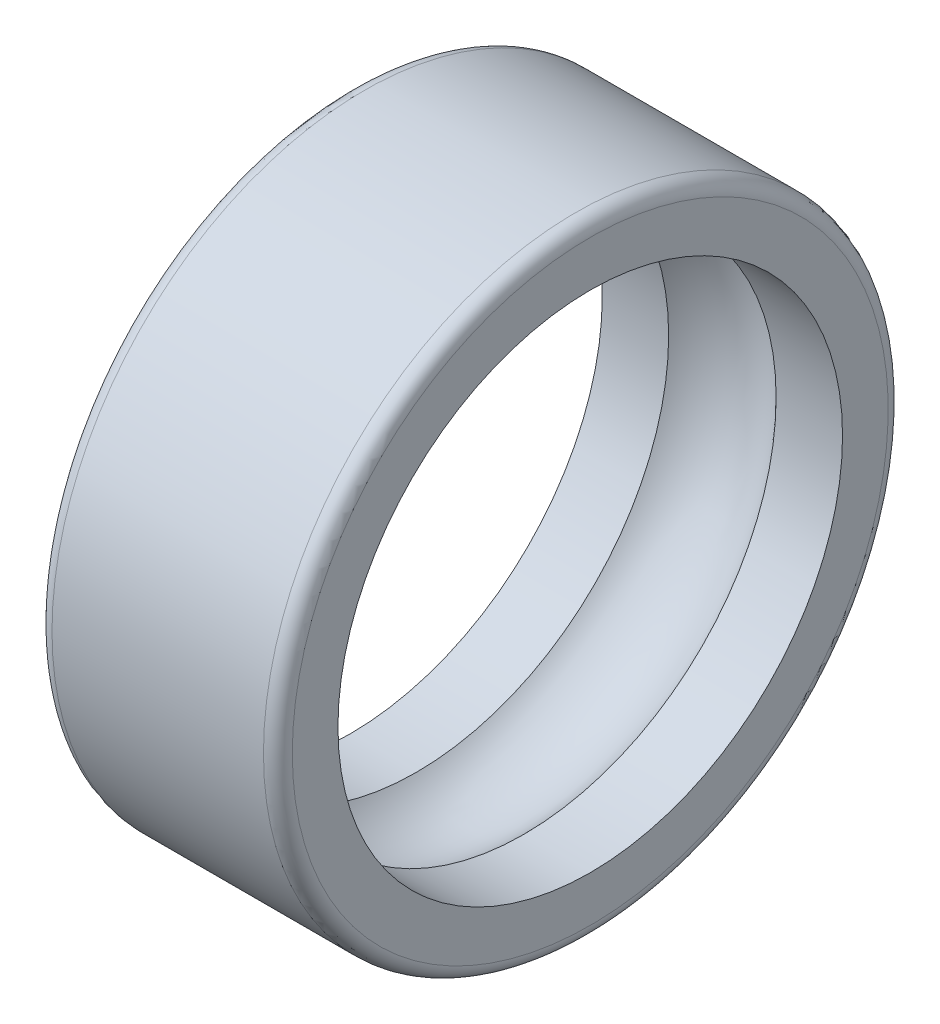
ISO-10303-21;
HEADER;
FILE_DESCRIPTION(('STEP AP214'),'2;1');
FILE_NAME('part.step','',(''),(''),'','','');
FILE_SCHEMA(('AUTOMOTIVE_DESIGN { 1 0 10303 214 1 1 1 1 }'));
ENDSEC;
DATA;
#1=APPLICATION_CONTEXT('core data for automotive mechanical design processes');
#2=APPLICATION_PROTOCOL_DEFINITION('international standard','automotive_design',2000,#1);
#3=PRODUCT_CONTEXT('',#1,'mechanical');
#4=PRODUCT('Part','Part','',(#3));
#5=PRODUCT_RELATED_PRODUCT_CATEGORY('part','',(#4));
#6=PRODUCT_DEFINITION_FORMATION('','',#4);
#7=PRODUCT_DEFINITION_CONTEXT('part definition',#1,'design');
#8=PRODUCT_DEFINITION('design','',#6,#7);
#9=PRODUCT_DEFINITION_SHAPE('','',#8);
#10=(LENGTH_UNIT() NAMED_UNIT(*) SI_UNIT(.MILLI.,.METRE.));
#11=(NAMED_UNIT(*) PLANE_ANGLE_UNIT() SI_UNIT($,.RADIAN.));
#12=(NAMED_UNIT(*) SI_UNIT($,.STERADIAN.) SOLID_ANGLE_UNIT());
#13=UNCERTAINTY_MEASURE_WITH_UNIT(LENGTH_MEASURE(1.E-05),#10,'distance_accuracy_value','');
#14=(GEOMETRIC_REPRESENTATION_CONTEXT(3) GLOBAL_UNCERTAINTY_ASSIGNED_CONTEXT((#13)) GLOBAL_UNIT_ASSIGNED_CONTEXT((#10,
#11,#12)) REPRESENTATION_CONTEXT('',''));
#15=CARTESIAN_POINT('',(0.,0.,0.));
#16=DIRECTION('',(0.,0.,1.));
#17=DIRECTION('',(1.,0.,0.));
#18=AXIS2_PLACEMENT_3D('',#15,#16,#17);
#19=CARTESIAN_POINT('',(0.,5.25,0.));
#20=DIRECTION('',(1.,0.,0.));
#21=DIRECTION('',(0.,0.,-1.));
#22=AXIS2_PLACEMENT_3D('',#19,#20,#21);
#23=PLANE('',#22);
#24=CARTESIAN_POINT('',(0.,0.,0.));
#25=DIRECTION('',(1.,0.,0.));
#26=DIRECTION('',(0.,0.,-1.));
#27=AXIS2_PLACEMENT_3D('',#24,#25,#26);
#28=CIRCLE('',#27,6.2);
#29=CARTESIAN_POINT('',(0.,0.,-6.2));
#30=VERTEX_POINT('',#29);
#31=EDGE_CURVE('E10',#30,#30,#28,.F.);
#32=ORIENTED_EDGE('',*,*,#31,.T.);
#33=EDGE_LOOP('',(#32));
#34=FACE_BOUND('',#33,.T.);
#35=CARTESIAN_POINT('',(0.,0.,0.));
#36=DIRECTION('',(-1.,0.,0.));
#37=DIRECTION('',(0.,0.,1.));
#38=AXIS2_PLACEMENT_3D('',#35,#36,#37);
#39=CIRCLE('',#38,5.25);
#40=CARTESIAN_POINT('',(0.,0.,5.25));
#41=VERTEX_POINT('',#40);
#42=EDGE_CURVE('E48',#41,#41,#39,.T.);
#43=ORIENTED_EDGE('',*,*,#42,.F.);
#44=EDGE_LOOP('',(#43));
#45=FACE_BOUND('',#44,.T.);
#46=ADVANCED_FACE('F29',(#34,#45),#23,.F.);
#47=CARTESIAN_POINT('',(0.,0.,0.));
#48=DIRECTION('',(-1.,0.,0.));
#49=DIRECTION('',(0.,0.,1.));
#50=AXIS2_PLACEMENT_3D('',#47,#48,#49);
#51=CYLINDRICAL_SURFACE('',#50,5.25);
#52=CARTESIAN_POINT('',(1.3819660112501,0.,0.));
#53=DIRECTION('',(-1.,0.,0.));
#54=DIRECTION('',(0.,0.,1.));
#55=AXIS2_PLACEMENT_3D('',#52,#53,#54);
#56=CIRCLE('',#55,5.25);
#57=CARTESIAN_POINT('',(1.3819660112501,0.,5.25));
#58=VERTEX_POINT('',#57);
#59=EDGE_CURVE('E51',#58,#58,#56,.T.);
#60=ORIENTED_EDGE('',*,*,#59,.F.);
#61=EDGE_LOOP('',(#60));
#62=FACE_BOUND('',#61,.T.);
#63=ORIENTED_EDGE('',*,*,#42,.T.);
#64=EDGE_LOOP('',(#63));
#65=FACE_BOUND('',#64,.T.);
#66=ADVANCED_FACE('F72',(#62,#65),#51,.F.);
#67=CARTESIAN_POINT('',(2.5,0.,0.));
#68=DIRECTION('',(-1.,0.,0.));
#69=DIRECTION('',(0.,0.,1.));
#70=AXIS2_PLACEMENT_3D('',#67,#68,#69);
#71=TOROIDAL_SURFACE('',#70,4.25,1.5);
#72=CARTESIAN_POINT('',(3.61803398874989,0.,0.));
#73=DIRECTION('',(-1.,0.,0.));
#74=DIRECTION('',(0.,0.,1.));
#75=AXIS2_PLACEMENT_3D('',#72,#73,#74);
#76=CIRCLE('',#75,5.25);
#77=CARTESIAN_POINT('',(3.61803398874989,0.,5.25));
#78=VERTEX_POINT('',#77);
#79=EDGE_CURVE('E54',#78,#78,#76,.T.);
#80=ORIENTED_EDGE('',*,*,#79,.F.);
#81=EDGE_LOOP('',(#80));
#82=FACE_BOUND('',#81,.T.);
#83=ORIENTED_EDGE('',*,*,#59,.T.);
#84=EDGE_LOOP('',(#83));
#85=FACE_BOUND('',#84,.T.);
#86=ADVANCED_FACE('F66',(#82,#85),#71,.F.);
#87=CARTESIAN_POINT('',(0.,0.,0.));
#88=DIRECTION('',(-1.,0.,0.));
#89=DIRECTION('',(0.,0.,1.));
#90=AXIS2_PLACEMENT_3D('',#87,#88,#89);
#91=CYLINDRICAL_SURFACE('',#90,5.25);
#92=CARTESIAN_POINT('',(5.,0.,0.));
#93=DIRECTION('',(-1.,0.,0.));
#94=DIRECTION('',(0.,0.,1.));
#95=AXIS2_PLACEMENT_3D('',#92,#93,#94);
#96=CIRCLE('',#95,5.25);
#97=CARTESIAN_POINT('',(5.,0.,5.25));
#98=VERTEX_POINT('',#97);
#99=EDGE_CURVE('E57',#98,#98,#96,.T.);
#100=ORIENTED_EDGE('',*,*,#99,.F.);
#101=EDGE_LOOP('',(#100));
#102=FACE_BOUND('',#101,.T.);
#103=ORIENTED_EDGE('',*,*,#79,.T.);
#104=EDGE_LOOP('',(#103));
#105=FACE_BOUND('',#104,.T.);
#106=ADVANCED_FACE('F63',(#102,#105),#91,.F.);
#107=CARTESIAN_POINT('',(5.,5.25,0.));
#108=DIRECTION('',(-1.,0.,0.));
#109=DIRECTION('',(0.,0.,1.));
#110=AXIS2_PLACEMENT_3D('',#107,#108,#109);
#111=PLANE('',#110);
#112=CARTESIAN_POINT('',(5.,0.,0.));
#113=DIRECTION('',(-1.,0.,0.));
#114=DIRECTION('',(0.,0.,1.));
#115=AXIS2_PLACEMENT_3D('',#112,#113,#114);
#116=CIRCLE('',#115,6.2);
#117=CARTESIAN_POINT('',(5.,0.,6.2));
#118=VERTEX_POINT('',#117);
#119=EDGE_CURVE('E35',#118,#118,#116,.F.);
#120=ORIENTED_EDGE('',*,*,#119,.T.);
#121=EDGE_LOOP('',(#120));
#122=FACE_BOUND('',#121,.T.);
#123=ORIENTED_EDGE('',*,*,#99,.T.);
#124=EDGE_LOOP('',(#123));
#125=FACE_BOUND('',#124,.T.);
#126=ADVANCED_FACE('F61',(#122,#125),#111,.F.);
#127=CARTESIAN_POINT('',(0.,0.,0.));
#128=DIRECTION('',(-1.,0.,0.));
#129=DIRECTION('',(0.,0.,1.));
#130=AXIS2_PLACEMENT_3D('',#127,#128,#129);
#131=CYLINDRICAL_SURFACE('',#130,6.5);
#132=CARTESIAN_POINT('',(4.7,0.,0.));
#133=DIRECTION('',(-1.,0.,0.));
#134=DIRECTION('',(0.,0.,1.));
#135=AXIS2_PLACEMENT_3D('',#132,#133,#134);
#136=CIRCLE('',#135,6.5);
#137=CARTESIAN_POINT('',(4.7,0.,6.5));
#138=VERTEX_POINT('',#137);
#139=EDGE_CURVE('E39',#138,#138,#136,.T.);
#140=ORIENTED_EDGE('',*,*,#139,.T.);
#141=EDGE_LOOP('',(#140));
#142=FACE_BOUND('',#141,.T.);
#143=CARTESIAN_POINT('',(0.3,0.,0.));
#144=DIRECTION('',(1.,0.,0.));
#145=DIRECTION('',(0.,0.,-1.));
#146=AXIS2_PLACEMENT_3D('',#143,#144,#145);
#147=CIRCLE('',#146,6.5);
#148=CARTESIAN_POINT('',(0.3,0.,-6.5));
#149=VERTEX_POINT('',#148);
#150=EDGE_CURVE('E43',#149,#149,#147,.T.);
#151=ORIENTED_EDGE('',*,*,#150,.T.);
#152=EDGE_LOOP('',(#151));
#153=FACE_BOUND('',#152,.T.);
#154=ADVANCED_FACE('F101',(#142,#153),#131,.T.);
#155=CARTESIAN_POINT('',(4.7,0.,0.));
#156=DIRECTION('',(-1.,0.,0.));
#157=DIRECTION('',(0.,0.,1.));
#158=AXIS2_PLACEMENT_3D('',#155,#156,#157);
#159=TOROIDAL_SURFACE('',#158,6.2,0.3);
#160=ORIENTED_EDGE('',*,*,#119,.F.);
#161=EDGE_LOOP('',(#160));
#162=FACE_BOUND('',#161,.T.);
#163=ORIENTED_EDGE('',*,*,#139,.F.);
#164=EDGE_LOOP('',(#163));
#165=FACE_BOUND('',#164,.T.);
#166=ADVANCED_FACE('F108',(#162,#165),#159,.T.);
#167=CARTESIAN_POINT('',(0.3,0.,0.));
#168=DIRECTION('',(1.,0.,0.));
#169=DIRECTION('',(0.,0.,-1.));
#170=AXIS2_PLACEMENT_3D('',#167,#168,#169);
#171=TOROIDAL_SURFACE('',#170,6.2,0.3);
#172=ORIENTED_EDGE('',*,*,#150,.F.);
#173=EDGE_LOOP('',(#172));
#174=FACE_BOUND('',#173,.T.);
#175=ORIENTED_EDGE('',*,*,#31,.F.);
#176=EDGE_LOOP('',(#175));
#177=FACE_BOUND('',#176,.T.);
#178=ADVANCED_FACE('F116',(#174,#177),#171,.T.);
#179=CLOSED_SHELL('',(#46,#66,#86,#106,#126,#154,#166,#178));
#180=MANIFOLD_SOLID_BREP('B2',#179);
#181=ADVANCED_BREP_SHAPE_REPRESENTATION('',(#18,#180),#14);
#182=SHAPE_DEFINITION_REPRESENTATION(#9,#181);
ENDSEC;
END-ISO-10303-21;
